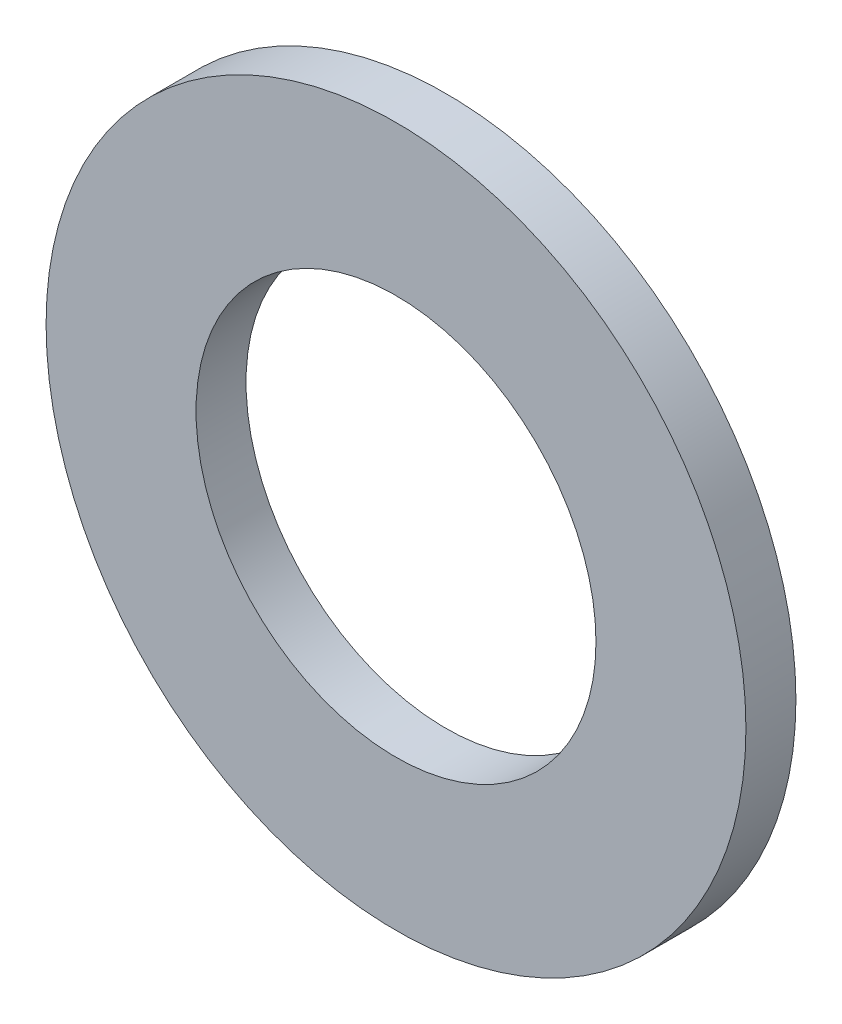
ISO-10303-21;
HEADER;
FILE_DESCRIPTION(('STEP AP214'),'2;1');
FILE_NAME('part.step','',(''),(''),'','','');
FILE_SCHEMA(('AUTOMOTIVE_DESIGN { 1 0 10303 214 1 1 1 1 }'));
ENDSEC;
DATA;
#1=APPLICATION_CONTEXT('core data for automotive mechanical design processes');
#2=APPLICATION_PROTOCOL_DEFINITION('international standard','automotive_design',2000,#1);
#3=PRODUCT_CONTEXT('',#1,'mechanical');
#4=PRODUCT('Part','Part','',(#3));
#5=PRODUCT_RELATED_PRODUCT_CATEGORY('part','',(#4));
#6=PRODUCT_DEFINITION_FORMATION('','',#4);
#7=PRODUCT_DEFINITION_CONTEXT('part definition',#1,'design');
#8=PRODUCT_DEFINITION('design','',#6,#7);
#9=PRODUCT_DEFINITION_SHAPE('','',#8);
#10=(LENGTH_UNIT() NAMED_UNIT(*) SI_UNIT(.MILLI.,.METRE.));
#11=(NAMED_UNIT(*) PLANE_ANGLE_UNIT() SI_UNIT($,.RADIAN.));
#12=(NAMED_UNIT(*) SI_UNIT($,.STERADIAN.) SOLID_ANGLE_UNIT());
#13=UNCERTAINTY_MEASURE_WITH_UNIT(LENGTH_MEASURE(1.E-05),#10,'distance_accuracy_value','');
#14=(GEOMETRIC_REPRESENTATION_CONTEXT(3) GLOBAL_UNCERTAINTY_ASSIGNED_CONTEXT((#13)) GLOBAL_UNIT_ASSIGNED_CONTEXT((#10,
#11,#12)) REPRESENTATION_CONTEXT('',''));
#15=CARTESIAN_POINT('',(0.,0.,0.));
#16=DIRECTION('',(0.,0.,1.));
#17=DIRECTION('',(1.,0.,0.));
#18=AXIS2_PLACEMENT_3D('',#15,#16,#17);
#19=CARTESIAN_POINT('',(0.,0.,1.));
#20=DIRECTION('',(0.,0.,1.));
#21=DIRECTION('',(1.,0.,0.));
#22=AXIS2_PLACEMENT_3D('',#19,#20,#21);
#23=PLANE('',#22);
#24=CARTESIAN_POINT('',(0.,0.,1.));
#25=DIRECTION('',(0.,0.,1.));
#26=DIRECTION('',(1.,0.,0.));
#27=AXIS2_PLACEMENT_3D('',#24,#25,#26);
#28=CIRCLE('',#27,7.);
#29=CARTESIAN_POINT('',(7.,0.,1.));
#30=VERTEX_POINT('',#29);
#31=EDGE_CURVE('E11',#30,#30,#28,.T.);
#32=ORIENTED_EDGE('',*,*,#31,.T.);
#33=EDGE_LOOP('',(#32));
#34=FACE_BOUND('',#33,.T.);
#35=CARTESIAN_POINT('',(0.,0.,1.));
#36=DIRECTION('',(0.,0.,1.));
#37=DIRECTION('',(1.,0.,0.));
#38=AXIS2_PLACEMENT_3D('',#35,#36,#37);
#39=CIRCLE('',#38,4.);
#40=CARTESIAN_POINT('',(4.,0.,1.));
#41=VERTEX_POINT('',#40);
#42=EDGE_CURVE('E47',#41,#41,#39,.T.);
#43=ORIENTED_EDGE('',*,*,#42,.F.);
#44=EDGE_LOOP('',(#43));
#45=FACE_BOUND('',#44,.T.);
#46=ADVANCED_FACE('F36',(#34,#45),#23,.T.);
#47=CARTESIAN_POINT('',(0.,0.,0.));
#48=DIRECTION('',(0.,0.,1.));
#49=DIRECTION('',(1.,0.,0.));
#50=AXIS2_PLACEMENT_3D('',#47,#48,#49);
#51=PLANE('',#50);
#52=CARTESIAN_POINT('',(0.,0.,0.));
#53=DIRECTION('',(0.,0.,1.));
#54=DIRECTION('',(1.,0.,0.));
#55=AXIS2_PLACEMENT_3D('',#52,#53,#54);
#56=CIRCLE('',#55,7.);
#57=CARTESIAN_POINT('',(7.,0.,0.));
#58=VERTEX_POINT('',#57);
#59=EDGE_CURVE('E40',#58,#58,#56,.T.);
#60=ORIENTED_EDGE('',*,*,#59,.F.);
#61=EDGE_LOOP('',(#60));
#62=FACE_BOUND('',#61,.T.);
#63=CARTESIAN_POINT('',(0.,0.,0.));
#64=DIRECTION('',(0.,0.,1.));
#65=DIRECTION('',(1.,0.,0.));
#66=AXIS2_PLACEMENT_3D('',#63,#64,#65);
#67=CIRCLE('',#66,4.);
#68=CARTESIAN_POINT('',(4.,0.,0.));
#69=VERTEX_POINT('',#68);
#70=EDGE_CURVE('E49',#69,#69,#67,.T.);
#71=ORIENTED_EDGE('',*,*,#70,.T.);
#72=EDGE_LOOP('',(#71));
#73=FACE_BOUND('',#72,.T.);
#74=ADVANCED_FACE('F59',(#62,#73),#51,.F.);
#75=CARTESIAN_POINT('',(0.,0.,1.));
#76=DIRECTION('',(0.,0.,-1.));
#77=DIRECTION('',(-1.,0.,0.));
#78=AXIS2_PLACEMENT_3D('',#75,#76,#77);
#79=CYLINDRICAL_SURFACE('',#78,7.);
#80=ORIENTED_EDGE('',*,*,#31,.F.);
#81=EDGE_LOOP('',(#80));
#82=FACE_BOUND('',#81,.T.);
#83=ORIENTED_EDGE('',*,*,#59,.T.);
#84=EDGE_LOOP('',(#83));
#85=FACE_BOUND('',#84,.T.);
#86=ADVANCED_FACE('F38',(#82,#85),#79,.T.);
#87=CARTESIAN_POINT('',(0.,0.,1.));
#88=DIRECTION('',(0.,0.,-1.));
#89=DIRECTION('',(-1.,0.,0.));
#90=AXIS2_PLACEMENT_3D('',#87,#88,#89);
#91=CYLINDRICAL_SURFACE('',#90,4.);
#92=ORIENTED_EDGE('',*,*,#42,.T.);
#93=EDGE_LOOP('',(#92));
#94=FACE_BOUND('',#93,.T.);
#95=ORIENTED_EDGE('',*,*,#70,.F.);
#96=EDGE_LOOP('',(#95));
#97=FACE_BOUND('',#96,.T.);
#98=ADVANCED_FACE('F55',(#94,#97),#91,.F.);
#99=CLOSED_SHELL('',(#46,#74,#86,#98));
#100=MANIFOLD_SOLID_BREP('B2',#99);
#101=ADVANCED_BREP_SHAPE_REPRESENTATION('',(#18,#100),#14);
#102=SHAPE_DEFINITION_REPRESENTATION(#9,#101);
ENDSEC;
END-ISO-10303-21;
